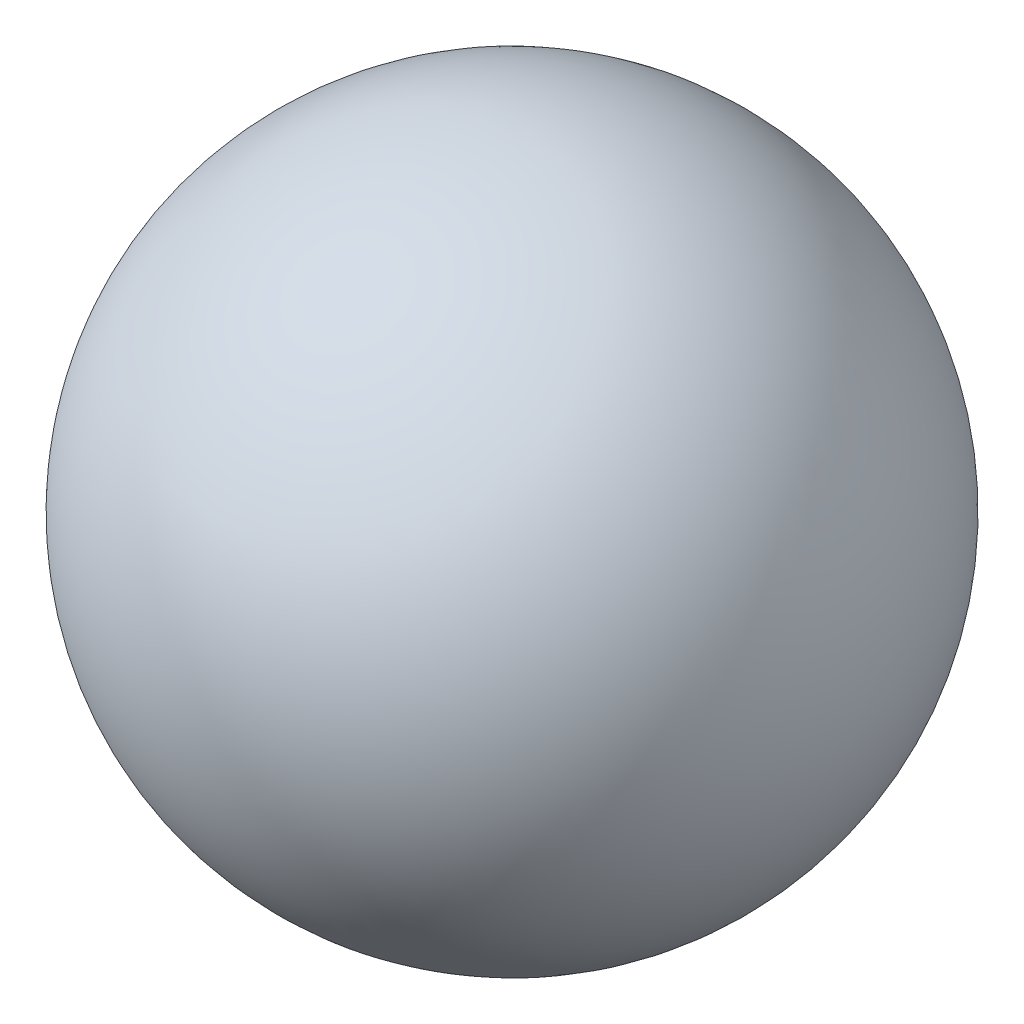
ISO-10303-21;
HEADER;
FILE_DESCRIPTION(('STEP AP214'),'2;1');
FILE_NAME('part.step','',(''),(''),'','','');
FILE_SCHEMA(('AUTOMOTIVE_DESIGN { 1 0 10303 214 1 1 1 1 }'));
ENDSEC;
DATA;
#1=APPLICATION_CONTEXT('core data for automotive mechanical design processes');
#2=APPLICATION_PROTOCOL_DEFINITION('international standard','automotive_design',2000,#1);
#3=PRODUCT_CONTEXT('',#1,'mechanical');
#4=PRODUCT('Part','Part','',(#3));
#5=PRODUCT_RELATED_PRODUCT_CATEGORY('part','',(#4));
#6=PRODUCT_DEFINITION_FORMATION('','',#4);
#7=PRODUCT_DEFINITION_CONTEXT('part definition',#1,'design');
#8=PRODUCT_DEFINITION('design','',#6,#7);
#9=PRODUCT_DEFINITION_SHAPE('','',#8);
#10=(LENGTH_UNIT() NAMED_UNIT(*) SI_UNIT(.MILLI.,.METRE.));
#11=(NAMED_UNIT(*) PLANE_ANGLE_UNIT() SI_UNIT($,.RADIAN.));
#12=(NAMED_UNIT(*) SI_UNIT($,.STERADIAN.) SOLID_ANGLE_UNIT());
#13=UNCERTAINTY_MEASURE_WITH_UNIT(LENGTH_MEASURE(1.E-05),#10,'distance_accuracy_value','');
#14=(GEOMETRIC_REPRESENTATION_CONTEXT(3) GLOBAL_UNCERTAINTY_ASSIGNED_CONTEXT((#13)) GLOBAL_UNIT_ASSIGNED_CONTEXT((#10,
#11,#12)) REPRESENTATION_CONTEXT('',''));
#15=CARTESIAN_POINT('',(0.,0.,0.));
#16=DIRECTION('',(0.,0.,1.));
#17=DIRECTION('',(1.,0.,0.));
#18=AXIS2_PLACEMENT_3D('',#15,#16,#17);
#19=CARTESIAN_POINT('',(67.76,68.0175725963269,-13.5161227559313));
#20=DIRECTION('',(0.,0.980822273280607,-0.194904254024027));
#21=DIRECTION('',(0.173648177666933,0.191943220457923,0.9659213790538));
#22=AXIS2_PLACEMENT_3D('',#19,#20,#21);
#23=SPHERICAL_SURFACE('',#22,7.15);
#24=CARTESIAN_POINT('',(67.76,75.0304518502832,-14.9096881722031));
#25=VERTEX_POINT('',#24);
#26=VERTEX_LOOP('',#25);
#27=FACE_BOUND('',#26,.T.);
#28=CARTESIAN_POINT('',(67.76,61.0046933423706,-12.1225573396595));
#29=VERTEX_POINT('',#28);
#30=VERTEX_LOOP('',#29);
#31=FACE_BOUND('',#30,.T.);
#32=ADVANCED_FACE('F16',(#27,#31),#23,.T.);
#33=CLOSED_SHELL('',(#32));
#34=MANIFOLD_SOLID_BREP('B1',#33);
#35=ADVANCED_BREP_SHAPE_REPRESENTATION('',(#18,#34),#14);
#36=SHAPE_DEFINITION_REPRESENTATION(#9,#35);
ENDSEC;
END-ISO-10303-21;
